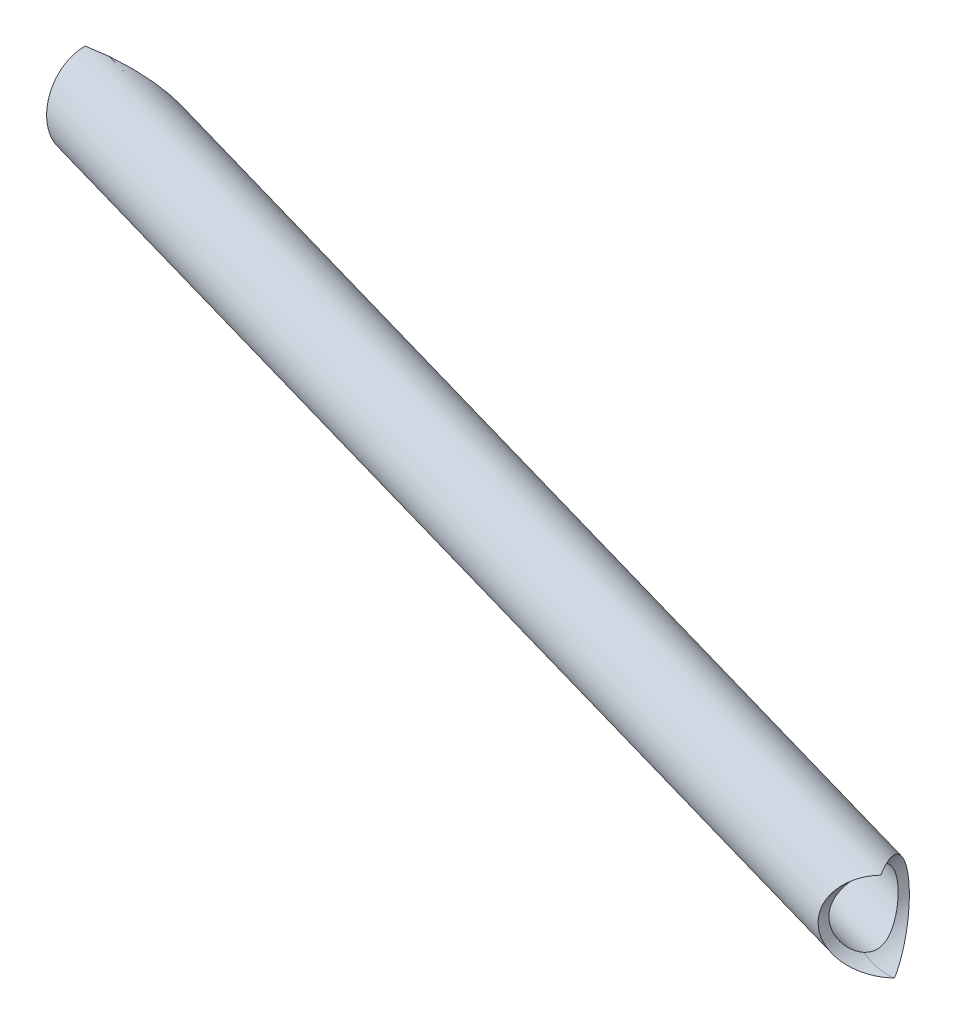
ISO-10303-21;
HEADER;
FILE_DESCRIPTION(('STEP AP214'),'2;1');
FILE_NAME('part.step','',(''),(''),'','','');
FILE_SCHEMA(('AUTOMOTIVE_DESIGN { 1 0 10303 214 1 1 1 1 }'));
ENDSEC;
DATA;
#1=APPLICATION_CONTEXT('core data for automotive mechanical design processes');
#2=APPLICATION_PROTOCOL_DEFINITION('international standard','automotive_design',2000,#1);
#3=PRODUCT_CONTEXT('',#1,'mechanical');
#4=PRODUCT('Part','Part','',(#3));
#5=PRODUCT_RELATED_PRODUCT_CATEGORY('part','',(#4));
#6=PRODUCT_DEFINITION_FORMATION('','',#4);
#7=PRODUCT_DEFINITION_CONTEXT('part definition',#1,'design');
#8=PRODUCT_DEFINITION('design','',#6,#7);
#9=PRODUCT_DEFINITION_SHAPE('','',#8);
#10=(LENGTH_UNIT() NAMED_UNIT(*) SI_UNIT(.MILLI.,.METRE.));
#11=(NAMED_UNIT(*) PLANE_ANGLE_UNIT() SI_UNIT($,.RADIAN.));
#12=(NAMED_UNIT(*) SI_UNIT($,.STERADIAN.) SOLID_ANGLE_UNIT());
#13=UNCERTAINTY_MEASURE_WITH_UNIT(LENGTH_MEASURE(1.E-05),#10,'distance_accuracy_value','');
#14=(GEOMETRIC_REPRESENTATION_CONTEXT(3) GLOBAL_UNCERTAINTY_ASSIGNED_CONTEXT((#13)) GLOBAL_UNIT_ASSIGNED_CONTEXT((#10,
#11,#12)) REPRESENTATION_CONTEXT('',''));
#15=CARTESIAN_POINT('',(0.,0.,0.));
#16=DIRECTION('',(0.,0.,1.));
#17=DIRECTION('',(1.,0.,0.));
#18=AXIS2_PLACEMENT_3D('',#15,#16,#17);
#19=CARTESIAN_POINT('',(900.,503.049546279118,167.449999999999));
#20=DIRECTION('',(-0.914545522624735,-0.155523085877016,-0.373388613653845));
#21=DIRECTION('',(-0.377987872602403,0.,0.925810546583646));
#22=AXIS2_PLACEMENT_3D('',#19,#20,#21);
#23=CYLINDRICAL_SURFACE('',#22,12.7);
#24=CARTESIAN_POINT('',(900.,503.049546279118,167.449999999999));
#25=DIRECTION('',(-0.816941933505309,-0.138925102510415,0.559737164366524));
#26=DIRECTION('',(-0.551815136060001,-0.0938389513377034,-0.828670203897137));
#27=AXIS2_PLACEMENT_3D('',#24,#25,#26);
#28=ELLIPSE('',#27,22.6892205994095,12.7);
#29=CARTESIAN_POINT('',(902.129132667718,490.52929092696,167.449999999999));
#30=VERTEX_POINT('',#29);
#31=CARTESIAN_POINT('',(897.870867332281,515.569801631277,167.449999999999));
#32=VERTEX_POINT('',#31);
#33=EDGE_CURVE('E89',#30,#32,#28,.F.);
#34=ORIENTED_EDGE('',*,*,#33,.F.);
#35=CARTESIAN_POINT('',(902.129132667718,490.52929092696,167.449999999999));
#36=CARTESIAN_POINT('',(902.122622527037,490.528183844689,167.454198455936));
#37=CARTESIAN_POINT('',(902.116111504246,490.527081459243,167.458396889795));
#38=CARTESIAN_POINT('',(901.661299132018,490.45041536341,167.751627534305));
#39=CARTESIAN_POINT('',(901.208847162959,490.397112413899,168.04054100451));
#40=CARTESIAN_POINT('',(900.299484677143,490.335760767951,168.616293994502));
#41=CARTESIAN_POINT('',(899.842572533139,490.32772925748,168.903132685398));
#42=CARTESIAN_POINT('',(898.926631418943,490.357934896545,169.473822874049));
#43=CARTESIAN_POINT('',(898.467600059604,490.396296410429,169.757664275964));
#44=CARTESIAN_POINT('',(897.552660406562,490.52075999025,170.319584412169));
#45=CARTESIAN_POINT('',(897.096750878394,490.606841932938,170.597665524278));
#46=CARTESIAN_POINT('',(896.283921842593,490.805769685706,171.090344072895));
#47=CARTESIAN_POINT('',(895.925668563482,490.90965400373,171.306384384694));
#48=CARTESIAN_POINT('',(895.216171297338,491.149540275628,171.732156637292));
#49=CARTESIAN_POINT('',(894.864927129832,491.285541401378,171.94188874059));
#50=CARTESIAN_POINT('',(894.172842247707,491.590176165168,172.353107853072));
#51=CARTESIAN_POINT('',(893.831983583372,491.758749311541,172.554609320319));
#52=CARTESIAN_POINT('',(893.163108244727,492.129355034394,172.947951310032));
#53=CARTESIAN_POINT('',(892.835089202271,492.33138140445,173.139793615926));
#54=CARTESIAN_POINT('',(892.254086847868,492.72908433124,173.477578121337));
#55=CARTESIAN_POINT('',(891.998378942181,492.919124407548,173.625483593816));
#56=CARTESIAN_POINT('',(891.4999444911,493.321753147347,173.912150115556));
#57=CARTESIAN_POINT('',(891.257215399974,493.534337364329,174.050912959349));
#58=CARTESIAN_POINT('',(890.786938932366,493.981808619295,174.317903503734));
#59=CARTESIAN_POINT('',(890.559391735893,494.216695921644,174.446131079414));
#60=CARTESIAN_POINT('',(890.121833183771,494.708139912072,174.690540454786));
#61=CARTESIAN_POINT('',(889.911822108782,494.964696946834,174.806722061695));
#62=CARTESIAN_POINT('',(889.510236955432,495.500401226087,175.026297197397));
#63=CARTESIAN_POINT('',(889.318813416184,495.779703855027,175.129587978495));
#64=CARTESIAN_POINT('',(888.95860792515,496.357569203389,175.320772835931));
#65=CARTESIAN_POINT('',(888.789826307408,496.65613220687,175.40866668512));
#66=CARTESIAN_POINT('',(888.477224114984,497.270110105648,175.567529235537));
#67=CARTESIAN_POINT('',(888.333387301978,497.585513861869,175.638508958702));
#68=CARTESIAN_POINT('',(888.072437140031,498.230598909394,175.762341295895));
#69=CARTESIAN_POINT('',(887.955319983527,498.560278158459,175.815196493217));
#70=CARTESIAN_POINT('',(887.762409272802,499.187798586848,175.89627615038));
#71=CARTESIAN_POINT('',(887.683245575699,499.484315569086,175.926786943619));
#72=CARTESIAN_POINT('',(887.546899187133,500.083481602296,175.972885213894));
#73=CARTESIAN_POINT('',(887.489714330709,500.386130046214,175.988474160989));
#74=CARTESIAN_POINT('',(887.397593601685,500.995121831296,176.004540111915));
#75=CARTESIAN_POINT('',(887.362653553058,501.301464467938,176.005019953005));
#76=CARTESIAN_POINT('',(887.314929652733,501.915520464499,175.990916470395));
#77=CARTESIAN_POINT('',(887.302145963986,502.223233834482,175.976333035913));
#78=CARTESIAN_POINT('',(887.29842517406,502.82565048861,175.93322311519));
#79=CARTESIAN_POINT('',(887.306650429231,503.120390442243,175.905266258473));
#80=CARTESIAN_POINT('',(887.342624992098,503.707082390096,175.836075759905));
#81=CARTESIAN_POINT('',(887.370373506881,503.999034497053,175.794842657288));
#82=CARTESIAN_POINT('',(887.444647974888,504.578437265887,175.699612322176));
#83=CARTESIAN_POINT('',(887.491175222671,504.865887616004,175.645614209797));
#84=CARTESIAN_POINT('',(887.602129826446,505.434739926397,175.525464868647));
#85=CARTESIAN_POINT('',(887.666559078194,505.716141242701,175.45931235302));
#86=CARTESIAN_POINT('',(887.817865353703,506.29252311627,175.310097862798));
#87=CARTESIAN_POINT('',(887.906071350084,506.586921595353,175.226135532974));
#88=CARTESIAN_POINT('',(888.100808217771,507.165680403899,175.045839560192));
#89=CARTESIAN_POINT('',(888.207339802163,507.450040342223,174.949505435859));
#90=CARTESIAN_POINT('',(888.437457923756,508.007553820313,174.745376245834));
#91=CARTESIAN_POINT('',(888.561046744315,508.280705853378,174.637579646168));
#92=CARTESIAN_POINT('',(888.824037826602,508.814857363497,174.411425357395));
#93=CARTESIAN_POINT('',(888.96344592924,509.075852301322,174.293063770872));
#94=CARTESIAN_POINT('',(889.277309284251,509.620331604221,174.029503350167));
#95=CARTESIAN_POINT('',(889.453940293249,509.901868947411,173.882864714691));
#96=CARTESIAN_POINT('',(889.824380945655,510.447063200639,173.578366631511));
#97=CARTESIAN_POINT('',(890.018197061927,510.710713306786,173.420502960308));
#98=CARTESIAN_POINT('',(890.623025880253,511.473687796183,172.931887315737));
#99=CARTESIAN_POINT('',(891.057494571499,511.945165582597,172.586047418827));
#100=CARTESIAN_POINT('',(892.048749340857,512.876593746906,171.807065483814));
#101=CARTESIAN_POINT('',(892.614027407438,513.32308335057,171.36874556503));
#102=CARTESIAN_POINT('',(893.795916698795,514.105727293516,170.463901611869));
#103=CARTESIAN_POINT('',(894.412528096342,514.441881261426,169.997377482567));
#104=CARTESIAN_POINT('',(895.499277982196,514.920119523027,169.18519795424));
#105=CARTESIAN_POINT('',(895.960355441554,515.090214064727,168.843499306014));
#106=CARTESIAN_POINT('',(896.896339096839,515.3720931315,168.156052534914));
#107=CARTESIAN_POINT('',(897.371223250566,515.483965732568,167.81031134242));
#108=CARTESIAN_POINT('',(897.857378162866,515.567501754868,167.459725628872));
#109=CARTESIAN_POINT('',(897.86412230349,515.568654611534,167.454862809429));
#110=CARTESIAN_POINT('',(897.870867332281,515.569801631277,167.449999999999));
#111=B_SPLINE_CURVE_WITH_KNOTS('',3,(#35,#36,#37,#38,#39,#40,#41,#42,#43,#44,#45,#46,#47,#48,
#49,#50,#51,#52,#53,#54,#55,#56,#57,#58,#59,#60,#61,#62,#63,#64,#65,#66,#67,#68,#69,#70,#71,#72,
#73,#74,#75,#76,#77,#78,#79,#80,#81,#82,#83,#84,#85,#86,#87,#88,#89,#90,#91,#92,#93,#94,#95,#96,
#97,#98,#99,#100,#101,#102,#103,#104,#105,#106,#107,#108,#109,#110),.UNSPECIFIED.,.F.,.F.,(4,2,
2,2,2,2,2,2,2,2,2,2,2,2,2,2,2,2,2,2,2,2,2,2,2,2,2,2,2,2,2,2,2,2,2,2,2,4),(0.,0.0234759311194202,
1.63963604782687,3.25640965072118,4.87752691239777,6.49796108383418,7.78994422334894,
9.08189405307033,10.3714671864165,11.6608013386846,12.7135619076379,13.7661152194769,
14.8186810090961,15.8712636413793,16.9317625084439,17.9922770196716,19.0520985548112,
20.1117689704603,21.0358418001486,21.9598235833632,22.8836318558748,23.8074469225797,
24.6950084902585,25.5825340128319,26.4701207297598,27.357801474689,28.3126018825566,
29.2674394520615,30.2224049646076,31.1777242308237,32.2664105191893,33.355508623433,
35.5332220114024,38.0532389822262,40.5732644349785,42.3663045735679,44.1566243247933,
44.1818063663016),.UNSPECIFIED.);
#112=EDGE_CURVE('E90',#32,#30,#111,.F.);
#113=ORIENTED_EDGE('',*,*,#112,.F.);
#114=EDGE_LOOP('',(#34,#113));
#115=FACE_BOUND('',#114,.T.);
#116=CARTESIAN_POINT('',(489.862566335555,433.303603907535,-2.27595720048157E-12));
#117=DIRECTION('',(0.,0.,-1.));
#118=DIRECTION('',(-0.985846878122719,-0.16764824155263,0.));
#119=AXIS2_PLACEMENT_3D('',#116,#117,#118);
#120=ELLIPSE('',#119,34.0128207866932,12.7);
#121=CARTESIAN_POINT('',(487.733433667837,445.823859259693,-2.27595720048157E-12));
#122=VERTEX_POINT('',#121);
#123=CARTESIAN_POINT('',(491.991699003274,420.783348555376,-2.27595720048157E-12));
#124=VERTEX_POINT('',#123);
#125=EDGE_CURVE('E11',#122,#124,#120,.T.);
#126=ORIENTED_EDGE('',*,*,#125,.F.);
#127=CARTESIAN_POINT('',(489.862566335555,433.303603907535,-2.27595720048157E-12));
#128=DIRECTION('',(-0.985846878122719,-0.16764824155263,0.));
#129=DIRECTION('',(0.,0.,-1.));
#130=AXIS2_PLACEMENT_3D('',#127,#128,#129);
#131=ELLIPSE('',#130,13.6901390279901,12.7);
#132=EDGE_CURVE('E54',#124,#122,#131,.T.);
#133=ORIENTED_EDGE('',*,*,#132,.F.);
#134=EDGE_LOOP('',(#126,#133));
#135=FACE_BOUND('',#134,.T.);
#136=ADVANCED_FACE('F44',(#115,#135),#23,.T.);
#137=CARTESIAN_POINT('',(900.,420.499546279117,167.449999999999));
#138=DIRECTION('',(-1.,0.,0.));
#139=DIRECTION('',(0.,0.,1.));
#140=AXIS2_PLACEMENT_3D('',#137,#138,#139);
#141=TOROIDAL_SURFACE('',#140,82.5500000000008,12.7);
#142=CARTESIAN_POINT('',(900.,503.049546279118,167.449999999999));
#143=DIRECTION('',(0.,0.,-1.));
#144=DIRECTION('',(-1.,0.,0.));
#145=AXIS2_PLACEMENT_3D('',#142,#143,#144);
#146=CIRCLE('',#145,12.7);
#147=CARTESIAN_POINT('',(889.707055664031,510.488988253933,167.449999999999));
#148=VERTEX_POINT('',#147);
#149=EDGE_CURVE('E81',#148,#32,#146,.T.);
#150=ORIENTED_EDGE('',*,*,#149,.T.);
#151=ORIENTED_EDGE('',*,*,#112,.T.);
#152=CARTESIAN_POINT('',(892.744756187759,492.62594626641,167.449999999999));
#153=VERTEX_POINT('',#152);
#154=EDGE_CURVE('E84',#30,#153,#146,.T.);
#155=ORIENTED_EDGE('',*,*,#154,.T.);
#156=CARTESIAN_POINT('',(889.707121764974,510.489079707743,167.449799999999));
#157=CARTESIAN_POINT('',(889.67008511259,510.437838400286,167.561869968516));
#158=CARTESIAN_POINT('',(889.631870926055,510.383952087896,167.672307172637));
#159=CARTESIAN_POINT('',(889.553497677238,510.27108768359,167.8898056604));
#160=CARTESIAN_POINT('',(889.513339065407,510.21211076852,167.996867716538));
#161=CARTESIAN_POINT('',(889.390670662329,510.02800755622,168.312553010159));
#162=CARTESIAN_POINT('',(889.30584295024,509.895537794002,168.516047155908));
#163=CARTESIAN_POINT('',(889.133652971057,509.613471622576,168.907777024132));
#164=CARTESIAN_POINT('',(889.046305582128,509.463964620117,169.096084282118));
#165=CARTESIAN_POINT('',(888.871424254841,509.14875938673,169.458641236342));
#166=CARTESIAN_POINT('',(888.783890258369,508.983055046362,169.632885582626));
#167=CARTESIAN_POINT('',(888.611594863405,508.637827478004,169.966441441058));
#168=CARTESIAN_POINT('',(888.526821456761,508.458380235158,170.125825593605));
#169=CARTESIAN_POINT('',(888.36172064306,508.086227707166,170.430751024282));
#170=CARTESIAN_POINT('',(888.281392696442,507.893524037398,170.576293983916));
#171=CARTESIAN_POINT('',(888.126934261045,507.495733598871,170.853814686475));
#172=CARTESIAN_POINT('',(888.052813799435,507.290627682644,170.985770557687));
#173=CARTESIAN_POINT('',(887.912594507022,506.869489767067,171.235812467442));
#174=CARTESIAN_POINT('',(887.846496347657,506.653456855308,171.353897345007));
#175=CARTESIAN_POINT('',(887.717714013774,506.189611889411,171.587150975649));
#176=CARTESIAN_POINT('',(887.656029655031,505.940780492514,171.700851357647));
#177=CARTESIAN_POINT('',(887.546002308917,505.433066302126,171.91101385785));
#178=CARTESIAN_POINT('',(887.497660098884,505.174182923989,172.007474971549));
#179=CARTESIAN_POINT('',(887.415912003329,504.648321341008,172.182757511855));
#180=CARTESIAN_POINT('',(887.382499922925,504.381346542688,172.261586247782));
#181=CARTESIAN_POINT('',(887.331921848897,503.841222956981,172.401263217537));
#182=CARTESIAN_POINT('',(887.314754941307,503.568074517814,172.462112462771));
#183=CARTESIAN_POINT('',(887.297993122068,503.026391777352,172.563857815952));
#184=CARTESIAN_POINT('',(887.297865828654,502.757980046967,172.605318057343));
#185=CARTESIAN_POINT('',(887.314535142293,502.219546541041,172.67077154422));
#186=CARTESIAN_POINT('',(887.331331529629,501.949524786448,172.694765016464));
#187=CARTESIAN_POINT('',(887.382205107885,501.410204636176,172.725129786164));
#188=CARTESIAN_POINT('',(887.416276539668,501.140906029474,172.731506951959));
#189=CARTESIAN_POINT('',(887.501712961963,500.605232452332,172.726643353113));
#190=CARTESIAN_POINT('',(887.553077016702,500.338857324497,172.715403541676));
#191=CARTESIAN_POINT('',(887.668670965838,499.829226046247,172.676809959621));
#192=CARTESIAN_POINT('',(887.731788967836,499.585629199174,172.650603473759));
#193=CARTESIAN_POINT('',(887.872161910616,499.104668626731,172.583243387153));
#194=CARTESIAN_POINT('',(887.949416105228,498.867304573123,172.54209057523));
#195=CARTESIAN_POINT('',(888.117210365357,498.40046249658,172.445170197452));
#196=CARTESIAN_POINT('',(888.207747196615,498.170982570639,172.389406186764));
#197=CARTESIAN_POINT('',(888.401053071856,497.721267499313,172.263640929023));
#198=CARTESIAN_POINT('',(888.50382238152,497.501032554862,172.193639372718));
#199=CARTESIAN_POINT('',(888.720701208146,497.070264308765,172.039530883197));
#200=CARTESIAN_POINT('',(888.834850136311,496.859768700349,171.955374182614));
#201=CARTESIAN_POINT('',(889.07269736572,496.450352008834,171.773524906689));
#202=CARTESIAN_POINT('',(889.196395703014,496.251430969436,171.675832280246));
#203=CARTESIAN_POINT('',(889.451867103633,495.865717566726,171.467093699098));
#204=CARTESIAN_POINT('',(889.583651028092,495.678942243739,171.356029581369));
#205=CARTESIAN_POINT('',(889.853310184359,495.31845806957,171.120872139577));
#206=CARTESIAN_POINT('',(889.991185549313,495.144749504226,170.996778530635));
#207=CARTESIAN_POINT('',(890.282325478391,494.797388188149,170.725066561243));
#208=CARTESIAN_POINT('',(890.435933233347,494.624874508767,170.576357504072));
#209=CARTESIAN_POINT('',(890.745064943452,494.296129406211,170.263611352127));
#210=CARTESIAN_POINT('',(890.900589316018,494.139901602577,170.099570865238));
#211=CARTESIAN_POINT('',(891.209735360029,493.844596846178,169.756270733527));
#212=CARTESIAN_POINT('',(891.363361294627,493.705470598083,169.577057472524));
#213=CARTESIAN_POINT('',(891.665147214922,493.444296629812,169.20249847375));
#214=CARTESIAN_POINT('',(891.813310196045,493.322239444684,169.007161772905));
#215=CARTESIAN_POINT('',(892.102279375522,493.093360888919,168.595657744687));
#216=CARTESIAN_POINT('',(892.242892565157,492.986872668086,168.379165417414));
#217=CARTESIAN_POINT('',(892.441498029712,492.841047194101,168.040952431166));
#218=CARTESIAN_POINT('',(892.505708717826,492.794714975542,167.925840366526));
#219=CARTESIAN_POINT('',(892.629197261375,492.706750232598,167.691145682434));
#220=CARTESIAN_POINT('',(892.688471544189,492.665121104341,167.571559914399));
#221=CARTESIAN_POINT('',(892.744848802594,492.625881803102,167.449799999999));
#222=B_SPLINE_CURVE_WITH_KNOTS('',3,(#156,#157,#158,#159,#160,#161,#162,#163,#164,#165,#166,
#167,#168,#169,#170,#171,#172,#173,#174,#175,#176,#177,#178,#179,#180,#181,#182,#183,#184,#185,
#186,#187,#188,#189,#190,#191,#192,#193,#194,#195,#196,#197,#198,#199,#200,#201,#202,#203,#204,
#205,#206,#207,#208,#209,#210,#211,#212,#213,#214,#215,#216,#217,#218,#219,#220,#221),
.UNSPECIFIED.,.F.,.F.,(4,2,2,2,2,2,2,2,2,2,2,2,2,2,2,2,2,2,2,2,2,2,2,2,2,2,2,2,2,2,2,2,4),(0.,
0.385927151135696,0.771765321265045,1.54216325141601,2.30868991508118,3.07550682730649,
3.83835374748479,4.60110787411809,5.36507124924067,6.12909852134163,6.96941066299186,
7.80977175240325,8.64978383056243,9.48974864624745,10.303463469471,11.1171677285962,
11.9306008940799,12.7439900484887,13.5020889044225,14.2601477560613,15.0180223294308,
15.7759133662775,16.5365269732377,17.2971434517919,18.058805016401,18.8204832375353,
19.643718078679,20.4671354956616,21.2881207923811,22.1086490246216,22.9447510527091,
23.363687457079,23.7829244698475),.UNSPECIFIED.);
#223=EDGE_CURVE('E78',#148,#153,#222,.T.);
#224=ORIENTED_EDGE('',*,*,#223,.F.);
#225=EDGE_LOOP('',(#150,#151,#155,#224));
#226=FACE_BOUND('',#225,.T.);
#227=ADVANCED_FACE('F80',(#226),#141,.F.);
#228=CARTESIAN_POINT('',(900.,503.049546279118,167.449999999999));
#229=DIRECTION('',(0.,0.,-1.));
#230=DIRECTION('',(-1.,0.,0.));
#231=AXIS2_PLACEMENT_3D('',#228,#229,#230);
#232=CYLINDRICAL_SURFACE('',#231,12.7);
#233=ORIENTED_EDGE('',*,*,#154,.F.);
#234=ORIENTED_EDGE('',*,*,#33,.T.);
#235=ORIENTED_EDGE('',*,*,#149,.F.);
#236=CARTESIAN_POINT('',(887.391748247447,501.525739288637,172.725629836838));
#237=CARTESIAN_POINT('',(887.422507809845,501.271227086945,172.738188507595));
#238=CARTESIAN_POINT('',(887.461032357995,501.01726638347,172.742853874987));
#239=CARTESIAN_POINT('',(887.553374172634,500.512349291848,172.736363748303));
#240=CARTESIAN_POINT('',(887.607191116358,500.261392840409,172.72520858812));
#241=CARTESIAN_POINT('',(887.729595903643,499.764321291795,172.687161663404));
#242=CARTESIAN_POINT('',(887.798184056515,499.518206296119,172.660269569318));
#243=CARTESIAN_POINT('',(887.949339146732,499.032550735458,172.590942868691));
#244=CARTESIAN_POINT('',(888.03190621441,498.793010231796,172.54850811723));
#245=CARTESIAN_POINT('',(888.209797069173,498.322578700214,172.448485002969));
#246=CARTESIAN_POINT('',(888.305093474673,498.091670431655,172.390928917058));
#247=CARTESIAN_POINT('',(888.507344035722,497.639348738015,172.260958693294));
#248=CARTESIAN_POINT('',(888.614298178502,497.417935302534,172.188544571714));
#249=CARTESIAN_POINT('',(888.838483642341,496.985732834522,172.029194320065));
#250=CARTESIAN_POINT('',(888.955717441454,496.774946383165,171.94225468382));
#251=CARTESIAN_POINT('',(889.198879295757,496.365042954308,171.754199991029));
#252=CARTESIAN_POINT('',(889.324807557176,496.165926253814,171.653084598185));
#253=CARTESIAN_POINT('',(889.588932193971,495.772314713037,171.432548034823));
#254=CARTESIAN_POINT('',(889.727419386818,495.578338896465,171.312548794346));
#255=CARTESIAN_POINT('',(890.00988010488,495.204652065362,171.057693454642));
#256=CARTESIAN_POINT('',(890.153853999096,495.024942012768,170.922836355013));
#257=CARTESIAN_POINT('',(890.445043510564,494.680333962115,170.638270688677));
#258=CARTESIAN_POINT('',(890.592260603071,494.515442885623,170.488555250011));
#259=CARTESIAN_POINT('',(890.887284268931,494.201108378058,170.174245304981));
#260=CARTESIAN_POINT('',(891.035090776406,494.051663268219,170.009652419244));
#261=CARTESIAN_POINT('',(891.311605730341,493.784860673694,169.685021355621));
#262=CARTESIAN_POINT('',(891.44056826495,493.665787690161,169.526607948409));
#263=CARTESIAN_POINT('',(891.694305903732,493.440476466362,169.197711727309));
#264=CARTESIAN_POINT('',(891.819080997294,493.334238258618,169.027228882842));
#265=CARTESIAN_POINT('',(892.061578090449,493.135110322839,168.674303708937));
#266=CARTESIAN_POINT('',(892.179310039079,493.042201493295,168.491879050142));
#267=CARTESIAN_POINT('',(892.404886019399,492.869940110478,168.114908204068));
#268=CARTESIAN_POINT('',(892.512732481348,492.790584221171,167.920365015881));
#269=CARTESIAN_POINT('',(892.69571139016,492.659768961861,167.558366203399));
#270=CARTESIAN_POINT('',(892.773137624438,492.605882368504,167.392944497937));
#271=CARTESIAN_POINT('',(892.917745695898,492.507282050377,167.055052841455));
#272=CARTESIAN_POINT('',(892.984929816884,492.462566279911,166.882584472619));
#273=CARTESIAN_POINT('',(893.107456641245,492.382390550169,166.531623223232));
#274=CARTESIAN_POINT('',(893.162813069603,492.346919852183,166.353137606818));
#275=CARTESIAN_POINT('',(893.260588679331,492.285082079779,165.991107001709));
#276=CARTESIAN_POINT('',(893.303007768464,492.258715070268,165.807561976952));
#277=CARTESIAN_POINT('',(893.374225888216,492.214839414525,165.43673509255));
#278=CARTESIAN_POINT('',(893.403019493805,492.197334296491,165.24945177537));
#279=CARTESIAN_POINT('',(893.446850173174,492.170810922791,164.872705292186));
#280=CARTESIAN_POINT('',(893.461887276453,492.161792648927,164.683242130857));
#281=CARTESIAN_POINT('',(893.478656509395,492.151740394171,164.303358733076));
#282=CARTESIAN_POINT('',(893.48037599758,492.150713999403,164.112937758922));
#283=CARTESIAN_POINT('',(893.471357420701,492.156115270638,163.732479160727));
#284=CARTESIAN_POINT('',(893.460615538174,492.162545220845,163.542441672034));
#285=CARTESIAN_POINT('',(893.420284574977,492.186850355667,163.076940739934));
#286=CARTESIAN_POINT('',(893.3843157173,492.208619314958,162.802225280082));
#287=CARTESIAN_POINT('',(893.292182422369,492.265388315617,162.257597583221));
#288=CARTESIAN_POINT('',(893.236007701561,492.300395094696,161.987687865584));
#289=CARTESIAN_POINT('',(893.106977052367,492.382676951284,161.45287005017));
#290=CARTESIAN_POINT('',(893.034065162668,492.429993258527,161.187982033853));
#291=CARTESIAN_POINT('',(892.874921593875,492.536107420122,160.664650790592));
#292=CARTESIAN_POINT('',(892.788690501205,492.594904769012,160.406207280488));
#293=CARTESIAN_POINT('',(892.624987968737,492.70996303891,159.949999848184));
#294=CARTESIAN_POINT('',(892.549527494635,492.764125183132,159.750974052673));
#295=CARTESIAN_POINT('',(892.393088005877,492.879279363254,159.357102057013));
#296=CARTESIAN_POINT('',(892.312108388179,492.940272145966,159.16225631666));
#297=CARTESIAN_POINT('',(892.062262172523,493.133567235948,158.583900853917));
#298=CARTESIAN_POINT('',(891.886539665976,493.276151080477,158.206712520718));
#299=CARTESIAN_POINT('',(891.523241085339,493.589516791053,157.470650829774));
#300=CARTESIAN_POINT('',(891.335673264066,493.760279155601,157.111765028704));
#301=CARTESIAN_POINT('',(890.953582818782,494.131958925234,156.414025912199));
#302=CARTESIAN_POINT('',(890.759064542891,494.332857720497,156.0751604126));
#303=CARTESIAN_POINT('',(890.432718229692,494.695193903927,155.529528317995));
#304=CARTESIAN_POINT('',(890.301550172659,494.847542618463,155.316301519872));
#305=CARTESIAN_POINT('',(890.039520175467,495.167816388646,154.901609483533));
#306=CARTESIAN_POINT('',(889.908658238427,495.335741602277,154.700144364643));
#307=CARTESIAN_POINT('',(889.64901682159,495.687829362649,154.311193396801));
#308=CARTESIAN_POINT('',(889.520234049807,495.871962476599,154.123683304423));
#309=CARTESIAN_POINT('',(889.266366346894,496.257460177636,153.76475317242));
#310=CARTESIAN_POINT('',(889.141280223247,496.458819124299,153.593327904241));
#311=CARTESIAN_POINT('',(888.840109348596,496.977205751493,153.194344358851));
#312=CARTESIAN_POINT('',(888.667182866267,497.304670903765,152.977475184358));
#313=CARTESIAN_POINT('',(888.423165008414,497.824265056096,152.691605910152));
#314=CARTESIAN_POINT('',(888.344399188734,498.002164798994,152.602899718656));
#315=CARTESIAN_POINT('',(888.193054290885,498.367132756224,152.440148891822));
#316=CARTESIAN_POINT('',(888.120474122675,498.554199345974,152.36610167021));
#317=CARTESIAN_POINT('',(887.994001139313,498.905286251494,152.245108314629));
#318=CARTESIAN_POINT('',(887.93899455761,499.068063489711,152.195709818075));
#319=CARTESIAN_POINT('',(887.834841238723,499.398665870607,152.109182129323));
#320=CARTESIAN_POINT('',(887.785693344339,499.566490008201,152.072050511613));
#321=CARTESIAN_POINT('',(887.693901994512,499.906158909981,152.010794575845));
#322=CARTESIAN_POINT('',(887.65125525067,500.07800159044,151.986663666037));
#323=CARTESIAN_POINT('',(887.572957274896,500.424631817434,151.951890963221));
#324=CARTESIAN_POINT('',(887.537306119776,500.599419396281,151.941249318322));
#325=CARTESIAN_POINT('',(887.473312963667,500.950954495013,151.933685322012));
#326=CARTESIAN_POINT('',(887.444984450641,501.127705014971,151.936788099267));
#327=CARTESIAN_POINT('',(887.395910687517,501.481481734953,151.956700313217));
#328=CARTESIAN_POINT('',(887.375165459978,501.658507935796,151.973509790687));
#329=CARTESIAN_POINT('',(887.341245010061,502.011572366534,152.020476418756));
#330=CARTESIAN_POINT('',(887.328072788248,502.187610177493,152.050638851676));
#331=CARTESIAN_POINT('',(887.309120978138,502.537415440387,152.123689495969));
#332=CARTESIAN_POINT('',(887.303341539377,502.711182846327,152.166577964734));
#333=CARTESIAN_POINT('',(887.29886802536,503.052876340702,152.263553210117));
#334=CARTESIAN_POINT('',(887.300070915269,503.220850760697,152.317465871642));
#335=CARTESIAN_POINT('',(887.308888843496,503.552834625752,152.435989608102));
#336=CARTESIAN_POINT('',(887.316505890181,503.716842812379,152.500604028823));
#337=CARTESIAN_POINT('',(887.34823865028,504.201855167958,152.709079466827));
#338=CARTESIAN_POINT('',(887.381234683965,504.516021667352,152.867623651888));
#339=CARTESIAN_POINT('',(887.493194986359,505.311633396405,153.325140155141));
#340=CARTESIAN_POINT('',(887.587979490826,505.775866328229,153.650193186642));
#341=CARTESIAN_POINT('',(887.755647959707,506.428393463023,154.182438088262));
#342=CARTESIAN_POINT('',(887.815931394525,506.638973368752,154.367710187823));
#343=CARTESIAN_POINT('',(887.943273695504,507.045886266123,154.751214154267));
#344=CARTESIAN_POINT('',(888.010332220401,507.242219974496,154.949445368217));
#345=CARTESIAN_POINT('',(888.183045837875,507.712053533998,155.45514591085));
#346=CARTESIAN_POINT('',(888.291750064781,507.977241649601,155.769292382752));
#347=CARTESIAN_POINT('',(888.515498667426,508.478312110986,156.418179365104));
#348=CARTESIAN_POINT('',(888.63054676991,508.714176960089,156.752931994487));
#349=CARTESIAN_POINT('',(888.862318998036,509.157294654533,157.440602622702));
#350=CARTESIAN_POINT('',(888.979044169845,509.364528700842,157.793532349862));
#351=CARTESIAN_POINT('',(889.209073186897,509.750007592942,158.515784801085));
#352=CARTESIAN_POINT('',(889.32237860617,509.928265946505,158.885099783931));
#353=CARTESIAN_POINT('',(889.506416898931,510.204489348538,159.523874142356));
#354=CARTESIAN_POINT('',(889.579556804201,510.310321227577,159.78925774993));
#355=CARTESIAN_POINT('',(889.719016631767,510.506479651688,160.327520109598));
#356=CARTESIAN_POINT('',(889.785336215836,510.596805427946,160.600399232552));
#357=CARTESIAN_POINT('',(889.908190943199,510.760306687152,161.152735686703));
#358=CARTESIAN_POINT('',(889.964748354585,510.833521340459,161.432176349652));
#359=CARTESIAN_POINT('',(890.064933492275,510.960997075915,161.997635354888));
#360=CARTESIAN_POINT('',(890.108566658149,511.015266133627,162.283650875166));
#361=CARTESIAN_POINT('',(890.168452940393,511.088961248926,162.773321636147));
#362=CARTESIAN_POINT('',(890.188996866831,511.113963555245,162.975615970888));
#363=CARTESIAN_POINT('',(890.220713213514,511.152396578582,163.382010057824));
#364=CARTESIAN_POINT('',(890.231888726657,511.165831114634,163.586109191675));
#365=CARTESIAN_POINT('',(890.243691846539,511.180016381857,163.994793252976));
#366=CARTESIAN_POINT('',(890.244334647561,511.180785384086,164.199377054755));
#367=CARTESIAN_POINT('',(890.234233230751,511.168651414592,164.6078860796));
#368=CARTESIAN_POINT('',(890.223489361528,511.155748861431,164.811811322636));
#369=CARTESIAN_POINT('',(890.190094249479,511.115303785451,165.218939522297));
#370=CARTESIAN_POINT('',(890.167346483871,511.087642568591,165.422122981025));
#371=CARTESIAN_POINT('',(890.110156750172,511.017171509798,165.824177910326));
#372=CARTESIAN_POINT('',(890.075714752598,510.974361629674,166.023049370028));
#373=CARTESIAN_POINT('',(889.996071055564,510.873581016885,166.414861779757));
#374=CARTESIAN_POINT('',(889.950860961843,510.815598452868,166.60779796979));
#375=CARTESIAN_POINT('',(889.851230717434,510.684938826345,166.986147601369));
#376=CARTESIAN_POINT('',(889.796810428833,510.612261543797,167.171560930216));
#377=CARTESIAN_POINT('',(889.68620646915,510.460591321104,167.516532636032));
#378=CARTESIAN_POINT('',(889.630689818906,510.382868166849,167.676867338493));
#379=CARTESIAN_POINT('',(889.515130852974,510.216679714694,167.990193960696));
#380=CARTESIAN_POINT('',(889.455086864969,510.128210439922,168.143183132637));
#381=CARTESIAN_POINT('',(889.270374447396,509.847706167312,168.590774580145));
#382=CARTESIAN_POINT('',(889.141072704046,509.640504800504,168.874157460479));
#383=CARTESIAN_POINT('',(888.932586111129,509.280676419116,169.303701208481));
#384=CARTESIAN_POINT('',(888.853901235294,509.139076296238,169.45964667874));
#385=CARTESIAN_POINT('',(888.697766316238,508.844138874717,169.760777190185));
#386=CARTESIAN_POINT('',(888.620316384533,508.690800523284,169.905961263887));
#387=CARTESIAN_POINT('',(888.468328763998,508.373227917562,170.185755715587));
#388=CARTESIAN_POINT('',(888.393793108374,508.208986264522,170.320358775414));
#389=CARTESIAN_POINT('',(888.249169753929,507.870527935581,170.579010744368));
#390=CARTESIAN_POINT('',(888.179082352896,507.696310593339,170.70305894709));
#391=CARTESIAN_POINT('',(888.030180277459,507.300113232321,170.966273371896));
#392=CARTESIAN_POINT('',(887.952744579978,507.075937199503,171.102928078891));
#393=CARTESIAN_POINT('',(887.808510118848,506.615468986994,171.360606987992));
#394=CARTESIAN_POINT('',(887.741712778549,506.379175191598,171.481629098138));
#395=CARTESIAN_POINT('',(887.620593334909,505.896003505302,171.707791813468));
#396=CARTESIAN_POINT('',(887.566271518076,505.649125371479,171.812932053896));
#397=CARTESIAN_POINT('',(887.471697261533,505.146454954585,172.006965574633));
#398=CARTESIAN_POINT('',(887.431443788056,504.890663328013,172.095860048482));
#399=CARTESIAN_POINT('',(887.367443476109,504.380809412165,172.254242618065));
#400=CARTESIAN_POINT('',(887.343180666129,504.126985478102,172.324289009267));
#401=CARTESIAN_POINT('',(887.309972843708,503.61447518882,172.448452577073));
#402=CARTESIAN_POINT('',(887.30102758769,503.355788910987,172.502570006966));
#403=CARTESIAN_POINT('',(887.299139989228,502.835569042726,172.594505450677));
#404=CARTESIAN_POINT('',(887.306191669218,502.574036552184,172.632329546531));
#405=CARTESIAN_POINT('',(887.336671848154,502.050054513929,172.691430784887));
#406=CARTESIAN_POINT('',(887.360099963944,501.787604987815,172.712708314503));
#407=CARTESIAN_POINT('',(887.391748247447,501.525739288637,172.725629836838));
#408=B_SPLINE_CURVE_WITH_KNOTS('',3,(#236,#237,#238,#239,#240,#241,#242,#243,#244,#245,#246,
#247,#248,#249,#250,#251,#252,#253,#254,#255,#256,#257,#258,#259,#260,#261,#262,#263,#264,#265,
#266,#267,#268,#269,#270,#271,#272,#273,#274,#275,#276,#277,#278,#279,#280,#281,#282,#283,#284,
#285,#286,#287,#288,#289,#290,#291,#292,#293,#294,#295,#296,#297,#298,#299,#300,#301,#302,#303,
#304,#305,#306,#307,#308,#309,#310,#311,#312,#313,#314,#315,#316,#317,#318,#319,#320,#321,#322,
#323,#324,#325,#326,#327,#328,#329,#330,#331,#332,#333,#334,#335,#336,#337,#338,#339,#340,#341,
#342,#343,#344,#345,#346,#347,#348,#349,#350,#351,#352,#353,#354,#355,#356,#357,#358,#359,#360,
#361,#362,#363,#364,#365,#366,#367,#368,#369,#370,#371,#372,#373,#374,#375,#376,#377,#378,#379,
#380,#381,#382,#383,#384,#385,#386,#387,#388,#389,#390,#391,#392,#393,#394,#395,#396,#397,#398,
#399,#400,#401,#402,#403,#404,#405,#406,#407),.UNSPECIFIED.,.T.,.F.,(4,2,2,2,2,2,2,2,2,2,2,2,2,
2,2,2,2,2,2,2,2,2,2,2,2,2,2,2,2,2,2,2,2,2,2,2,2,2,2,2,2,2,2,2,2,2,2,2,2,2,2,2,2,2,2,2,2,2,2,2,2,
2,2,2,2,2,2,2,2,2,2,2,2,2,2,2,2,2,2,2,2,2,2,2,2,4),(0.,0.769770168203888,1.53952409065217,
2.30929413337286,3.07907135355653,3.84721862834658,4.61536506186494,5.38369717952553,
6.15204752780055,6.95170952293795,7.75142539342717,8.55151287037765,9.35151329717186,
10.0601934656383,10.7688754296997,11.4765314580838,12.1840130463129,12.7547257995289,
13.3253111075095,13.8952306623452,14.4651542803725,15.0353046247612,15.6054537465149,
16.1761440045883,16.7470091362344,17.5793951819188,18.4122054622121,19.2478419115659,
20.0834415796691,20.7421214695856,21.4008734450442,22.718834648195,24.0358875266263,
25.3521304224797,26.2307369008382,27.1093522914189,27.9864038361696,28.863169290479,
30.1452819425368,30.7861311551853,31.4268672021316,31.9626678072229,32.4983624057375,
33.033785134772,33.5692137425473,34.1056216678684,34.6420311889359,35.1786530991894,
35.7152858637122,36.2440201262261,36.772920004744,37.8301794640667,39.5436976838187,
40.403882357886,41.2640237257743,42.5379291794752,43.81259113876,45.0880861053842,
46.3629847508809,47.2472556516988,48.1315703831947,49.0138404889779,49.8957387346413,
50.509867662326,51.1237937610089,51.7368341439458,52.3498557588044,52.967883496656,
53.5859127926702,54.2044254590336,54.8229473878195,55.3822840069205,55.9418282568221,
57.0603829245363,57.7345042436687,58.4086860951514,59.0833302034028,59.7580194281106,
60.5782557120134,61.3986016467646,62.2189664194115,63.0392708974573,63.8316088106389,
64.6239341240419,65.4159634184319,66.2079741824109),.UNSPECIFIED.);
#409=EDGE_CURVE('E94',#153,#148,#408,.T.);
#410=ORIENTED_EDGE('',*,*,#409,.F.);
#411=EDGE_LOOP('',(#233,#234,#235,#410));
#412=FACE_BOUND('',#411,.T.);
#413=ADVANCED_FACE('F93',(#412),#232,.F.);
#414=CARTESIAN_POINT('',(-1.11022302462516E-13,350.,199.999999999996));
#415=DIRECTION('',(0.914545522624736,0.155523085877017,-0.373388613653842));
#416=DIRECTION('',(-0.377987872602399,0.,-0.925810546583647));
#417=AXIS2_PLACEMENT_3D('',#414,#415,#416);
#418=CYLINDRICAL_SURFACE('',#417,12.7);
#419=CARTESIAN_POINT('',(493.79261710663,434.592218803129,12.0278512394002));
#420=CARTESIAN_POINT('',(493.752822996385,434.859179683693,12.0116024487528));
#421=CARTESIAN_POINT('',(493.716761234098,435.126106773118,11.9845941156256));
#422=CARTESIAN_POINT('',(493.652619123801,435.658030720863,11.9093372070711));
#423=CARTESIAN_POINT('',(493.624543070737,435.923026466084,11.8610772373168));
#424=CARTESIAN_POINT('',(493.577013085689,436.449755342694,11.7437249737435));
#425=CARTESIAN_POINT('',(493.557577597666,436.71148034683,11.6745886405499));
#426=CARTESIAN_POINT('',(493.528265896236,437.229315846079,11.5163091227073));
#427=CARTESIAN_POINT('',(493.518388396179,437.485427092352,11.4271686329105));
#428=CARTESIAN_POINT('',(493.509225736446,437.990268348309,11.2299596624712));
#429=CARTESIAN_POINT('',(493.509933942983,438.239002882857,11.1219030780136));
#430=CARTESIAN_POINT('',(493.523171590768,438.727706040713,10.8880968313298));
#431=CARTESIAN_POINT('',(493.535701550213,438.967674279278,10.7623463937128));
#432=CARTESIAN_POINT('',(493.574063151102,439.437368629092,10.4947102225716));
#433=CARTESIAN_POINT('',(493.59989593701,439.667093857268,10.3528231016003));
#434=CARTESIAN_POINT('',(493.66658669005,440.114856825021,10.0548274837724));
#435=CARTESIAN_POINT('',(493.707444307309,440.332894836614,9.89871931813488));
#436=CARTESIAN_POINT('',(493.805404037624,440.752798435669,9.57698754256403));
#437=CARTESIAN_POINT('',(493.862257753111,440.954855074876,9.41153816955531));
#438=CARTESIAN_POINT('',(493.994441829212,441.345039528714,9.0717685608737));
#439=CARTESIAN_POINT('',(494.069772386089,441.533167195361,8.89744823098803));
#440=CARTESIAN_POINT('',(494.240690925128,441.893923415863,8.54353693621732));
#441=CARTESIAN_POINT('',(494.33623814198,442.066582178948,8.36395719511991));
#442=CARTESIAN_POINT('',(494.549268490939,442.395725880941,8.00299350324348));
#443=CARTESIAN_POINT('',(494.666746740775,442.552214407634,7.82160996251707));
#444=CARTESIAN_POINT('',(494.908478172859,442.829888418008,7.48352900295564));
#445=CARTESIAN_POINT('',(495.030088459137,442.953045655781,7.32655745785894));
#446=CARTESIAN_POINT('',(495.290603410902,443.186098713142,7.01721392222936));
#447=CARTESIAN_POINT('',(495.429505649276,443.295996389599,6.86484128991119));
#448=CARTESIAN_POINT('',(495.723689706526,443.502627923368,6.56720062815761));
#449=CARTESIAN_POINT('',(495.878970021047,443.599362987822,6.42193194800282));
#450=CARTESIAN_POINT('',(496.20434438846,443.780171143209,6.14039539362186));
#451=CARTESIAN_POINT('',(496.374440390423,443.864242564199,6.00412870780788));
#452=CARTESIAN_POINT('',(496.754683554797,444.032588971153,5.72154734699472));
#453=CARTESIAN_POINT('',(496.966960378677,444.114892711978,5.57692786641064));
#454=CARTESIAN_POINT('',(497.405264138982,444.265280589899,5.3019005718248));
#455=CARTESIAN_POINT('',(497.631294244879,444.33336143315,5.17149605316611));
#456=CARTESIAN_POINT('',(498.094395180809,444.457091424988,4.92428556180858));
#457=CARTESIAN_POINT('',(498.331484517155,444.51271876128,4.80750361768904));
#458=CARTESIAN_POINT('',(498.813854069845,444.613006080449,4.5867080740324));
#459=CARTESIAN_POINT('',(499.059137908902,444.657661137703,4.48270021941941));
#460=CARTESIAN_POINT('',(499.53623962399,444.734211495544,4.29390878398344));
#461=CARTESIAN_POINT('',(499.76760182288,444.766833549221,4.20825687533554));
#462=CARTESIAN_POINT('',(500.234195618186,444.824776120845,4.04565594830159));
#463=CARTESIAN_POINT('',(500.469426531262,444.850097913921,3.96870541148547));
#464=CARTESIAN_POINT('',(500.94306168398,444.894169806273,3.82240102831546));
#465=CARTESIAN_POINT('',(501.181468594655,444.912913957098,3.7530540969969));
#466=CARTESIAN_POINT('',(501.66055231837,444.944346728341,3.62109388936199));
#467=CARTESIAN_POINT('',(501.901229411757,444.957034590613,3.5584814568533));
#468=CARTESIAN_POINT('',(502.385640871027,444.976820221766,3.4388305949331));
#469=CARTESIAN_POINT('',(502.629384840748,444.983885769677,3.38182591154685));
#470=CARTESIAN_POINT('',(503.118143823788,444.992605787224,3.27306518788889));
#471=CARTESIAN_POINT('',(503.363158936229,444.994259828324,3.22130956360351));
#472=CARTESIAN_POINT('',(504.099285763151,444.99143771332,3.07299579958023));
#473=CARTESIAN_POINT('',(504.591780349694,444.979188991979,2.98331822240182));
#474=CARTESIAN_POINT('',(505.50319197147,444.938064415468,2.83083663967322));
#475=CARTESIAN_POINT('',(505.921913596217,444.911999040355,2.76601976506202));
#476=CARTESIAN_POINT('',(506.759477456737,444.845312122135,2.64484156185559));
#477=CARTESIAN_POINT('',(507.178319700742,444.804688961164,2.58848117405113));
#478=CARTESIAN_POINT('',(508.015829522442,444.708212989851,2.48269894966661));
#479=CARTESIAN_POINT('',(508.434495695679,444.652335395277,2.43328860467337));
#480=CARTESIAN_POINT('',(509.269976435447,444.524322226769,2.34039973906549));
#481=CARTESIAN_POINT('',(509.686791150768,444.452187984296,2.29692073312758));
#482=CARTESIAN_POINT('',(510.514623578433,444.290645206027,2.21530045922824));
#483=CARTESIAN_POINT('',(510.925661441205,444.201358173398,2.17712472256264));
#484=CARTESIAN_POINT('',(511.743482610493,444.003036954153,2.10509784220555));
#485=CARTESIAN_POINT('',(512.150264875987,443.893998049955,2.07124773495836));
#486=CARTESIAN_POINT('',(512.956375960617,443.653596015132,2.00747874800249));
#487=CARTESIAN_POINT('',(513.35572156836,443.522292350207,1.97754976350424));
#488=CARTESIAN_POINT('',(514.144901969188,443.233330172481,1.92120106969252));
#489=CARTESIAN_POINT('',(514.534743053693,443.075689667502,1.89477898453703));
#490=CARTESIAN_POINT('',(515.149660711354,442.796986173586,1.85501151193517));
#491=CARTESIAN_POINT('',(515.37921150991,442.685937334102,1.8406115218864));
#492=CARTESIAN_POINT('',(515.831630395295,442.450603086038,1.81303377029356));
#493=CARTESIAN_POINT('',(516.054496859025,442.326314495383,1.79985630400418));
#494=CARTESIAN_POINT('',(516.490805220697,442.063084752012,1.77479356797855));
#495=CARTESIAN_POINT('',(516.704269111168,441.924180684314,1.76290517606841));
#496=CARTESIAN_POINT('',(517.119235771433,441.629566884318,1.74047179345569));
#497=CARTESIAN_POINT('',(517.320745929804,441.47386770439,1.7299259681961));
#498=CARTESIAN_POINT('',(517.742622147129,441.113786312166,1.70854459970751));
#499=CARTESIAN_POINT('',(517.959887884782,440.905681119329,1.6979963344348));
#500=CARTESIAN_POINT('',(518.362493923616,440.460295099707,1.6793194342381));
#501=CARTESIAN_POINT('',(518.547869411887,440.223046930824,1.67118812518355));
#502=CARTESIAN_POINT('',(518.845118208666,439.763665233948,1.65902225082448));
#503=CARTESIAN_POINT('',(518.964194595503,439.546296360493,1.65451718046537));
#504=CARTESIAN_POINT('',(519.114342580831,439.207808282631,1.64945957469309));
#505=CARTESIAN_POINT('',(519.159646815441,439.09290903992,1.64805705115828));
#506=CARTESIAN_POINT('',(519.240046172435,438.85960516672,1.64584354752947));
#507=CARTESIAN_POINT('',(519.275145394248,438.741201964915,1.64503232970574));
#508=CARTESIAN_POINT('',(519.33470200888,438.501187312214,1.64401673976602));
#509=CARTESIAN_POINT('',(519.359111521617,438.379563962973,1.64381507458533));
#510=CARTESIAN_POINT('',(519.396787799421,438.13460668333,1.64403059350423));
#511=CARTESIAN_POINT('',(519.41005476034,438.011272783031,1.64444776672626));
#512=CARTESIAN_POINT('',(519.425497546105,437.763878012826,1.6458919099412));
#513=CARTESIAN_POINT('',(519.427669331537,437.639816894615,1.6469191018714));
#514=CARTESIAN_POINT('',(519.421272513329,437.391935985722,1.64956201692123));
#515=CARTESIAN_POINT('',(519.412698587021,437.268116345086,1.65117803142076));
#516=CARTESIAN_POINT('',(519.383055203291,437.000424704314,1.65529382142659));
#517=CARTESIAN_POINT('',(519.360091732657,436.856763082008,1.65789774179679));
#518=CARTESIAN_POINT('',(519.301477823177,436.572033993416,1.66381379561592));
#519=CARTESIAN_POINT('',(519.265818893445,436.430968329906,1.66712640245024));
#520=CARTESIAN_POINT('',(519.141779709112,436.012570564778,1.67804440168941));
#521=CARTESIAN_POINT('',(519.036360757352,435.740223343381,1.68662700244012));
#522=CARTESIAN_POINT('',(518.817026972636,435.268214506977,1.70390076640767));
#523=CARTESIAN_POINT('',(518.709629912393,435.065366810252,1.71218467865811));
#524=CARTESIAN_POINT('',(518.477542850454,434.669731419944,1.72995311354649));
#525=CARTESIAN_POINT('',(518.352842040983,434.476950118129,1.73943838621835));
#526=CARTESIAN_POINT('',(518.089453888345,434.100989431841,1.75951245511359));
#527=CARTESIAN_POINT('',(517.950748681459,433.917822775792,1.77010266135681));
#528=CARTESIAN_POINT('',(517.662054035481,433.560609905894,1.79231790086064));
#529=CARTESIAN_POINT('',(517.512060152532,433.386567330022,1.80394334198144));
#530=CARTESIAN_POINT('',(517.203777344629,433.047984015885,1.82812177897151));
#531=CARTESIAN_POINT('',(517.045542570893,432.883393283204,1.84066889873046));
#532=CARTESIAN_POINT('',(516.7215342759,432.561964515696,1.86674183893578));
#533=CARTESIAN_POINT('',(516.555761747423,432.405125465559,1.88026753063464));
#534=CARTESIAN_POINT('',(516.217703192513,432.098421794944,1.90832477432031));
#535=CARTESIAN_POINT('',(516.045411232187,431.94856381943,1.92285725317528));
#536=CARTESIAN_POINT('',(515.695393402718,431.655426151104,1.9529477402932));
#537=CARTESIAN_POINT('',(515.517666876776,431.512147258692,1.96850587277742));
#538=CARTESIAN_POINT('',(514.97578647658,431.090102625627,2.01693547643919));
#539=CARTESIAN_POINT('',(514.604552637673,430.820576207657,2.05142969765377));
#540=CARTESIAN_POINT('',(513.848165346743,430.303171698585,2.12521601357497));
#541=CARTESIAN_POINT('',(513.463018559316,430.055283431777,2.16450583199471));
#542=CARTESIAN_POINT('',(512.700381830075,429.590127434422,2.24662835576862));
#543=CARTESIAN_POINT('',(512.323409780238,429.371961509824,2.28920096749487));
#544=CARTESIAN_POINT('',(511.561302624294,428.951604199275,2.38024829273339));
#545=CARTESIAN_POINT('',(511.176166210191,428.749415397895,2.42872395795543));
#546=CARTESIAN_POINT('',(510.398590947756,428.359796401921,2.53277589516467));
#547=CARTESIAN_POINT('',(510.006140460208,428.172392756577,2.58836449067802));
#548=CARTESIAN_POINT('',(509.215855801202,427.812306009847,2.70802140027533));
#549=CARTESIAN_POINT('',(508.818022121188,427.639621575076,2.77208894492396));
#550=CARTESIAN_POINT('',(508.020340034963,427.309958086549,2.91019640996243));
#551=CARTESIAN_POINT('',(507.62051642341,427.152894318454,2.98417677901071));
#552=CARTESIAN_POINT('',(506.817605096899,426.853955395301,3.14482977792267));
#553=CARTESIAN_POINT('',(506.414516674005,426.712083634737,3.23150523416839));
#554=CARTESIAN_POINT('',(505.607485445267,426.445331082287,3.42045788636643));
#555=CARTESIAN_POINT('',(505.203547209944,426.320409182577,3.522696011638));
#556=CARTESIAN_POINT('',(504.395792924624,426.089704741618,3.74692386026641));
#557=CARTESIAN_POINT('',(503.991976955432,425.983910317771,3.86890123108934));
#558=CARTESIAN_POINT('',(503.345812096661,425.832706721491,4.08467302680983));
#559=CARTESIAN_POINT('',(503.102563305852,425.779933461834,4.17062266644975));
#560=CARTESIAN_POINT('',(502.61795372065,425.68424584644,4.35291145843976));
#561=CARTESIAN_POINT('',(502.376593073218,425.641332250887,4.44925141104523));
#562=CARTESIAN_POINT('',(501.897394719293,425.567086785036,4.65340421443335));
#563=CARTESIAN_POINT('',(501.659551844445,425.535735868811,4.76119781810959));
#564=CARTESIAN_POINT('',(501.188580605612,425.486540019566,4.9895017314305));
#565=CARTESIAN_POINT('',(500.955451495637,425.468692932915,5.11001000980687));
#566=CARTESIAN_POINT('',(500.529390339773,425.450274883573,5.34589706858812));
#567=CARTESIAN_POINT('',(500.335551625457,425.447565192913,5.45946385705598));
#568=CARTESIAN_POINT('',(499.954202154521,425.455230776046,5.69640439982327));
#569=CARTESIAN_POINT('',(499.766690788375,425.465604785746,5.81977720562608));
#570=CARTESIAN_POINT('',(499.399641250791,425.500887058243,6.0757131585881));
#571=CARTESIAN_POINT('',(499.220097105887,425.525784227106,6.20826922281438));
#572=CARTESIAN_POINT('',(498.870258836331,425.591319107761,6.48148413971418));
#573=CARTESIAN_POINT('',(498.699964567446,425.631956574037,6.6221428659737));
#574=CARTESIAN_POINT('',(498.369051369422,425.729987709525,6.91039416203771));
#575=CARTESIAN_POINT('',(498.208477347484,425.787452906511,7.05801402593408));
#576=CARTESIAN_POINT('',(497.89850014666,425.919375583248,7.3573351586261));
#577=CARTESIAN_POINT('',(497.749097367761,425.993833671042,7.50903657329703));
#578=CARTESIAN_POINT('',(497.461512340687,426.159613664358,7.81412866430845));
#579=CARTESIAN_POINT('',(497.323340428411,426.250950856474,7.96752075243699));
#580=CARTESIAN_POINT('',(497.058066971549,426.4498371833,8.27333794024415));
#581=CARTESIAN_POINT('',(496.930965535041,426.557386476259,8.42576303046868));
#582=CARTESIAN_POINT('',(496.694053010772,426.781325642469,8.71881898046199));
#583=CARTESIAN_POINT('',(496.583671586523,426.896878560702,8.85963114166327));
#584=CARTESIAN_POINT('',(496.37150719603,427.140757590849,9.13655497496807));
#585=CARTESIAN_POINT('',(496.269723728801,427.269082957587,9.27266692066966));
#586=CARTESIAN_POINT('',(496.07400260409,427.537585838694,9.53867460806882));
#587=CARTESIAN_POINT('',(495.980064807294,427.677763142521,9.66857046012603));
#588=CARTESIAN_POINT('',(495.799295512454,427.969040554611,9.92085194732244));
#589=CARTESIAN_POINT('',(495.712464697297,428.120141709892,10.0432368604763));
#590=CARTESIAN_POINT('',(495.532574155248,428.455980890995,10.2972573354069));
#591=CARTESIAN_POINT('',(495.440562816324,428.642347332084,10.4274866010716));
#592=CARTESIAN_POINT('',(495.264196537909,429.026905862575,10.6750380085331));
#593=CARTESIAN_POINT('',(495.179842242384,429.225098944293,10.7923590649099));
#594=CARTESIAN_POINT('',(495.018009387837,429.632083553374,11.0129715995084));
#595=CARTESIAN_POINT('',(494.940536954481,429.840884268033,11.1162506211997));
#596=CARTESIAN_POINT('',(494.79200658034,430.267515490118,11.3076367348055));
#597=CARTESIAN_POINT('',(494.72094862555,430.485345977828,11.3957438598432));
#598=CARTESIAN_POINT('',(494.578536372056,430.949218246238,11.5633853898388));
#599=CARTESIAN_POINT('',(494.507766006514,431.196002592804,11.6413664600158));
#600=CARTESIAN_POINT('',(494.373089886682,431.696892085192,11.7773544519912));
#601=CARTESIAN_POINT('',(494.30918547773,431.950998653428,11.8353574641215));
#602=CARTESIAN_POINT('',(494.188248660998,432.464128579128,11.9306447665938));
#603=CARTESIAN_POINT('',(494.131203165799,432.723141445007,11.9679690213511));
#604=CARTESIAN_POINT('',(494.02390384206,433.244609499236,12.0216508356967));
#605=CARTESIAN_POINT('',(493.97364639507,433.507062771122,12.0380196056346));
#606=CARTESIAN_POINT('',(493.902592942466,433.907016000403,12.0468592400685));
#607=CARTESIAN_POINT('',(493.879247538239,434.043937967808,12.0470352833734));
#608=CARTESIAN_POINT('',(493.834478957184,434.317982531666,12.0417039981627));
#609=CARTESIAN_POINT('',(493.813055744821,434.455105124362,12.0361967747329));
#610=CARTESIAN_POINT('',(493.79261710663,434.592218803129,12.0278512394002));
#611=B_SPLINE_CURVE_WITH_KNOTS('',3,(#419,#420,#421,#422,#423,#424,#425,#426,#427,#428,#429,
#430,#431,#432,#433,#434,#435,#436,#437,#438,#439,#440,#441,#442,#443,#444,#445,#446,#447,#448,
#449,#450,#451,#452,#453,#454,#455,#456,#457,#458,#459,#460,#461,#462,#463,#464,#465,#466,#467,
#468,#469,#470,#471,#472,#473,#474,#475,#476,#477,#478,#479,#480,#481,#482,#483,#484,#485,#486,
#487,#488,#489,#490,#491,#492,#493,#494,#495,#496,#497,#498,#499,#500,#501,#502,#503,#504,#505,
#506,#507,#508,#509,#510,#511,#512,#513,#514,#515,#516,#517,#518,#519,#520,#521,#522,#523,#524,
#525,#526,#527,#528,#529,#530,#531,#532,#533,#534,#535,#536,#537,#538,#539,#540,#541,#542,#543,
#544,#545,#546,#547,#548,#549,#550,#551,#552,#553,#554,#555,#556,#557,#558,#559,#560,#561,#562,
#563,#564,#565,#566,#567,#568,#569,#570,#571,#572,#573,#574,#575,#576,#577,#578,#579,#580,#581,
#582,#583,#584,#585,#586,#587,#588,#589,#590,#591,#592,#593,#594,#595,#596,#597,#598,#599,#600,
#601,#602,#603,#604,#605,#606,#607,#608,#609,#610),.UNSPECIFIED.,.T.,.F.,(4,2,2,2,2,2,2,2,2,2,2,
2,2,2,2,2,2,2,2,2,2,2,2,2,2,2,2,2,2,2,2,2,2,2,2,2,2,2,2,2,2,2,2,2,2,2,2,2,2,2,2,2,2,2,2,2,2,2,2,
2,2,2,2,2,2,2,2,2,2,2,2,2,2,2,2,2,2,2,2,2,2,2,2,2,2,2,2,2,2,2,2,2,2,2,2,4),(0.,
0.811069034840429,1.62257346482187,2.43580189361269,3.24892083434424,4.06153023601722,
4.87417525944903,5.68689020775014,6.49958623213004,7.30029954648056,8.10102136647145,
8.90014372382399,9.69908839281228,10.3990427362083,11.0988989439807,11.7986909246414,
12.4985751055608,13.306479733316,14.1145712547303,14.924067262257,15.7339260036759,
16.480170272878,17.2262841173423,17.9730709770646,18.7199512976704,19.4710817001065,
20.2222715829588,21.7237220913178,22.996940225174,24.2702999006829,25.5457408741745,
26.8210774238744,28.0876926162261,29.3546107296658,30.6181969163333,31.88092263523,
32.6467947742129,33.4128514019255,34.1770091001626,34.9406894442074,35.841339662711,
36.740989656799,37.4813076086226,37.8514508284818,38.2214451530214,38.5930801725559,
38.9647086598018,39.3364724360073,39.7084204305862,40.1442824296528,40.5804364881231,
41.4532990542999,42.1414646070289,42.8300619331869,43.5195489914409,44.2093089048082,
44.8949999760031,45.5806009965377,46.266841804802,46.9531658798525,48.3323304211417,
49.7108428530534,51.0232788179949,52.335926659037,53.6508803311688,54.9657147575188,
56.2729775974441,57.580531924644,58.8848561370581,60.1883672563876,60.9780343904245,
61.7677623876199,62.5561836808404,63.3444792077937,64.0178898231259,64.6912353812401,
65.3640672572015,66.0368886387928,66.7126124816748,67.3883605071994,68.064723551351,
68.7410931979766,69.3794370913306,70.0177437640347,70.6560391001264,71.294395696252,
72.0294348762344,72.764535816723,73.5002846605911,74.2360318981525,75.0400276036459,
75.8441805602956,76.6467739155793,77.4489377357309,77.8655183042398,78.2820911701439),.UNSPECIFIED.);
#612=CARTESIAN_POINT('',(493.79261710663,434.592218803129,12.0278512394002));
#613=VERTEX_POINT('',#612);
#614=EDGE_CURVE('E101',#613,#613,#611,.T.);
#615=ORIENTED_EDGE('',*,*,#614,.F.);
#616=EDGE_LOOP('',(#615));
#617=FACE_BOUND('',#616,.T.);
#618=ORIENTED_EDGE('',*,*,#125,.T.);
#619=ORIENTED_EDGE('',*,*,#132,.T.);
#620=EDGE_LOOP('',(#618,#619));
#621=FACE_BOUND('',#620,.T.);
#622=ADVANCED_FACE('F120',(#617,#621),#418,.F.);
#623=CARTESIAN_POINT('',(900.,503.049546279118,167.449999999999));
#624=DIRECTION('',(-0.914545522624735,-0.155523085877016,-0.373388613653845));
#625=DIRECTION('',(-0.377987872602403,0.,0.925810546583646));
#626=AXIS2_PLACEMENT_3D('',#623,#624,#625);
#627=CYLINDRICAL_SURFACE('',#626,9.65);
#628=ORIENTED_EDGE('',*,*,#223,.T.);
#629=ORIENTED_EDGE('',*,*,#409,.T.);
#630=EDGE_LOOP('',(#628,#629));
#631=FACE_BOUND('',#630,.T.);
#632=ORIENTED_EDGE('',*,*,#614,.T.);
#633=EDGE_LOOP('',(#632));
#634=FACE_BOUND('',#633,.T.);
#635=ADVANCED_FACE('F46',(#631,#634),#627,.F.);
#636=CLOSED_SHELL('',(#136,#227,#413,#622,#635));
#637=MANIFOLD_SOLID_BREP('B2',#636);
#638=ADVANCED_BREP_SHAPE_REPRESENTATION('',(#18,#637),#14);
#639=SHAPE_DEFINITION_REPRESENTATION(#9,#638);
ENDSEC;
END-ISO-10303-21;
